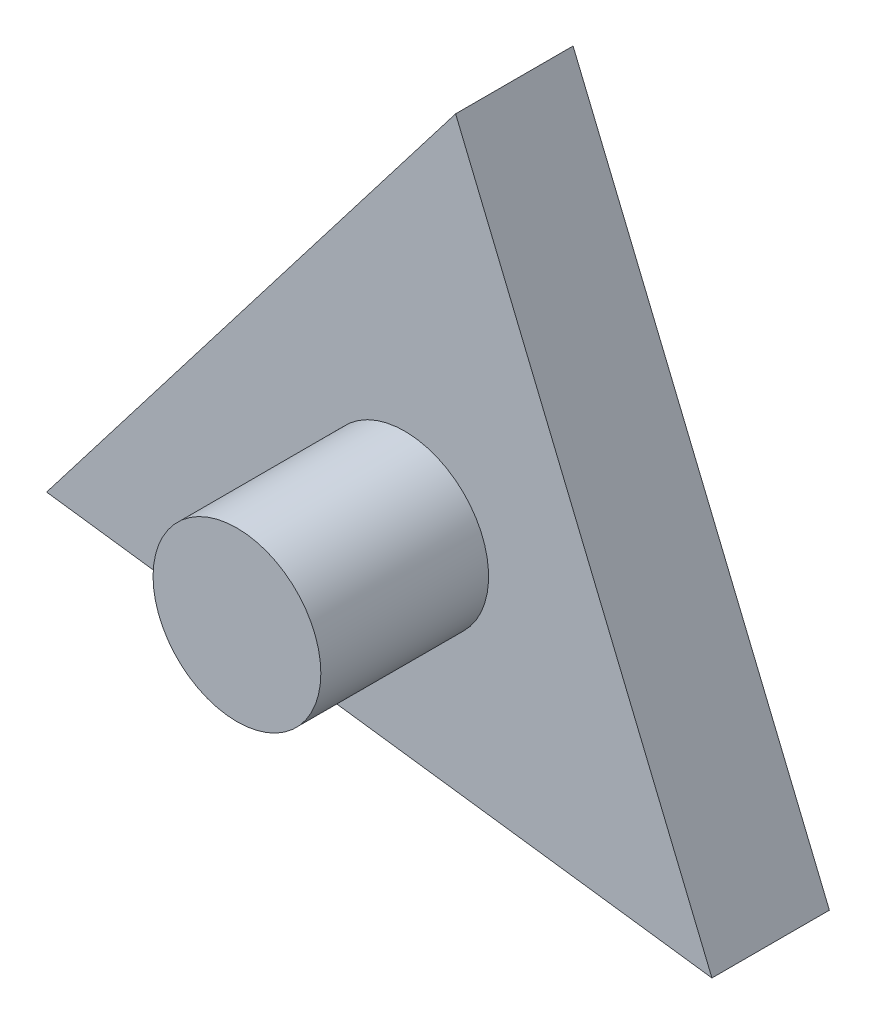
ISO-10303-21;
HEADER;
FILE_DESCRIPTION(('STEP AP214'),'2;1');
FILE_NAME('part.step','',(''),(''),'','','');
FILE_SCHEMA(('AUTOMOTIVE_DESIGN { 1 0 10303 214 1 1 1 1 }'));
ENDSEC;
DATA;
#1=APPLICATION_CONTEXT('core data for automotive mechanical design processes');
#2=APPLICATION_PROTOCOL_DEFINITION('international standard','automotive_design',2000,#1);
#3=PRODUCT_CONTEXT('',#1,'mechanical');
#4=PRODUCT('Part','Part','',(#3));
#5=PRODUCT_RELATED_PRODUCT_CATEGORY('part','',(#4));
#6=PRODUCT_DEFINITION_FORMATION('','',#4);
#7=PRODUCT_DEFINITION_CONTEXT('part definition',#1,'design');
#8=PRODUCT_DEFINITION('design','',#6,#7);
#9=PRODUCT_DEFINITION_SHAPE('','',#8);
#10=(LENGTH_UNIT() NAMED_UNIT(*) SI_UNIT(.MILLI.,.METRE.));
#11=(NAMED_UNIT(*) PLANE_ANGLE_UNIT() SI_UNIT($,.RADIAN.));
#12=(NAMED_UNIT(*) SI_UNIT($,.STERADIAN.) SOLID_ANGLE_UNIT());
#13=UNCERTAINTY_MEASURE_WITH_UNIT(LENGTH_MEASURE(1.E-05),#10,'distance_accuracy_value','');
#14=(GEOMETRIC_REPRESENTATION_CONTEXT(3) GLOBAL_UNCERTAINTY_ASSIGNED_CONTEXT((#13)) GLOBAL_UNIT_ASSIGNED_CONTEXT((#10,
#11,#12)) REPRESENTATION_CONTEXT('',''));
#15=CARTESIAN_POINT('',(0.,0.,0.));
#16=DIRECTION('',(0.,0.,1.));
#17=DIRECTION('',(1.,0.,0.));
#18=AXIS2_PLACEMENT_3D('',#15,#16,#17);
#19=CARTESIAN_POINT('',(18.309950916159,-14.0740552358296,7.));
#20=DIRECTION('',(0.131355005457612,0.991335393568307,0.));
#21=DIRECTION('',(-0.991335393568307,0.131355005457612,0.));
#22=AXIS2_PLACEMENT_3D('',#19,#20,#21);
#23=PLANE('',#22);
#24=DIRECTION('',(0.991335393568307,-0.131355005457612,0.));
#25=VECTOR('',#24,1.);
#26=CARTESIAN_POINT('',(18.309950916159,-14.0740552358296,0.));
#27=LINE('',#26,#25);
#28=CARTESIAN_POINT('',(-21.3434648265733,-8.81985501752508,0.));
#29=VERTEX_POINT('',#28);
#30=CARTESIAN_POINT('',(18.309950916159,-14.0740552358296,0.));
#31=VERTEX_POINT('',#30);
#32=EDGE_CURVE('E82',#29,#31,#27,.T.);
#33=ORIENTED_EDGE('',*,*,#32,.T.);
#34=DIRECTION('',(0.,0.,-1.));
#35=VECTOR('',#34,1.);
#36=CARTESIAN_POINT('',(18.309950916159,-14.0740552358296,7.));
#37=LINE('',#36,#35);
#38=CARTESIAN_POINT('',(18.309950916159,-14.0740552358296,7.));
#39=VERTEX_POINT('',#38);
#40=EDGE_CURVE('E41',#39,#31,#37,.T.);
#41=ORIENTED_EDGE('',*,*,#40,.F.);
#42=DIRECTION('',(0.991335393568307,-0.131355005457612,0.));
#43=VECTOR('',#42,1.);
#44=CARTESIAN_POINT('',(18.309950916159,-14.0740552358296,7.));
#45=LINE('',#44,#43);
#46=CARTESIAN_POINT('',(-21.3434648265733,-8.81985501752508,7.));
#47=VERTEX_POINT('',#46);
#48=EDGE_CURVE('E75',#47,#39,#45,.T.);
#49=ORIENTED_EDGE('',*,*,#48,.F.);
#50=DIRECTION('',(0.,0.,-1.));
#51=VECTOR('',#50,1.);
#52=CARTESIAN_POINT('',(-21.3434648265733,-8.81985501752508,7.));
#53=LINE('',#52,#51);
#54=EDGE_CURVE('E83',#47,#29,#53,.T.);
#55=ORIENTED_EDGE('',*,*,#54,.T.);
#56=EDGE_LOOP('',(#33,#41,#49,#55));
#57=FACE_BOUND('',#56,.T.);
#58=ADVANCED_FACE('F33',(#57),#23,.F.);
#59=CARTESIAN_POINT('',(3.03351391041432,22.8939102533546,7.));
#60=DIRECTION('',(-0.924199137229605,-0.381910925143618,0.));
#61=DIRECTION('',(0.381910925143618,-0.924199137229605,0.));
#62=AXIS2_PLACEMENT_3D('',#59,#60,#61);
#63=PLANE('',#62);
#64=DIRECTION('',(-0.381910925143618,0.924199137229605,0.));
#65=VECTOR('',#64,1.);
#66=CARTESIAN_POINT('',(3.03351391041432,22.8939102533546,0.));
#67=LINE('',#66,#65);
#68=CARTESIAN_POINT('',(3.03351391041432,22.8939102533546,0.));
#69=VERTEX_POINT('',#68);
#70=EDGE_CURVE('E62',#31,#69,#67,.T.);
#71=ORIENTED_EDGE('',*,*,#70,.T.);
#72=DIRECTION('',(0.,0.,-1.));
#73=VECTOR('',#72,1.);
#74=CARTESIAN_POINT('',(3.03351391041432,22.8939102533546,7.));
#75=LINE('',#74,#73);
#76=CARTESIAN_POINT('',(3.03351391041432,22.8939102533546,7.));
#77=VERTEX_POINT('',#76);
#78=EDGE_CURVE('E74',#77,#69,#75,.T.);
#79=ORIENTED_EDGE('',*,*,#78,.F.);
#80=DIRECTION('',(-0.381910925143618,0.924199137229605,0.));
#81=VECTOR('',#80,1.);
#82=CARTESIAN_POINT('',(3.03351391041432,22.8939102533546,7.));
#83=LINE('',#82,#81);
#84=EDGE_CURVE('E70',#39,#77,#83,.T.);
#85=ORIENTED_EDGE('',*,*,#84,.F.);
#86=ORIENTED_EDGE('',*,*,#40,.T.);
#87=EDGE_LOOP('',(#71,#79,#85,#86));
#88=FACE_BOUND('',#87,.T.);
#89=ADVANCED_FACE('F71',(#88),#63,.F.);
#90=CARTESIAN_POINT('',(-21.3434648265733,-8.81985501752508,7.));
#91=DIRECTION('',(0.792844131771992,-0.60942446842469,0.));
#92=DIRECTION('',(0.60942446842469,0.792844131771992,0.));
#93=AXIS2_PLACEMENT_3D('',#90,#91,#92);
#94=PLANE('',#93);
#95=DIRECTION('',(-0.60942446842469,-0.792844131771992,0.));
#96=VECTOR('',#95,1.);
#97=CARTESIAN_POINT('',(-21.3434648265733,-8.81985501752508,0.));
#98=LINE('',#97,#96);
#99=EDGE_CURVE('E67',#69,#29,#98,.T.);
#100=ORIENTED_EDGE('',*,*,#99,.T.);
#101=ORIENTED_EDGE('',*,*,#54,.F.);
#102=DIRECTION('',(-0.60942446842469,-0.792844131771992,0.));
#103=VECTOR('',#102,1.);
#104=CARTESIAN_POINT('',(-21.3434648265733,-8.81985501752508,7.));
#105=LINE('',#104,#103);
#106=EDGE_CURVE('E49',#77,#47,#105,.T.);
#107=ORIENTED_EDGE('',*,*,#106,.F.);
#108=ORIENTED_EDGE('',*,*,#78,.T.);
#109=EDGE_LOOP('',(#100,#101,#107,#108));
#110=FACE_BOUND('',#109,.T.);
#111=ADVANCED_FACE('F105',(#110),#94,.F.);
#112=CARTESIAN_POINT('',(0.,0.,7.));
#113=DIRECTION('',(0.,0.,-1.));
#114=DIRECTION('',(-1.,0.,0.));
#115=AXIS2_PLACEMENT_3D('',#112,#113,#114);
#116=PLANE('',#115);
#117=CARTESIAN_POINT('',(0.,0.,7.));
#118=DIRECTION('',(0.,0.,-1.));
#119=DIRECTION('',(-1.,0.,0.));
#120=AXIS2_PLACEMENT_3D('',#117,#118,#119);
#121=CIRCLE('',#120,5.);
#122=CARTESIAN_POINT('',(-5.,0.,7.));
#123=VERTEX_POINT('',#122);
#124=EDGE_CURVE('E11',#123,#123,#121,.F.);
#125=ORIENTED_EDGE('',*,*,#124,.F.);
#126=EDGE_LOOP('',(#125));
#127=FACE_BOUND('',#126,.T.);
#128=ORIENTED_EDGE('',*,*,#48,.T.);
#129=ORIENTED_EDGE('',*,*,#84,.T.);
#130=ORIENTED_EDGE('',*,*,#106,.T.);
#131=EDGE_LOOP('',(#128,#129,#130));
#132=FACE_BOUND('',#131,.T.);
#133=ADVANCED_FACE('F78',(#127,#132),#116,.F.);
#134=CARTESIAN_POINT('',(0.,0.,0.));
#135=DIRECTION('',(0.,0.,-1.));
#136=DIRECTION('',(-1.,0.,0.));
#137=AXIS2_PLACEMENT_3D('',#134,#135,#136);
#138=PLANE('',#137);
#139=ORIENTED_EDGE('',*,*,#32,.F.);
#140=ORIENTED_EDGE('',*,*,#99,.F.);
#141=ORIENTED_EDGE('',*,*,#70,.F.);
#142=EDGE_LOOP('',(#139,#140,#141));
#143=FACE_BOUND('',#142,.T.);
#144=ADVANCED_FACE('F100',(#143),#138,.T.);
#145=CARTESIAN_POINT('',(0.,0.,17.));
#146=DIRECTION('',(0.,0.,-1.));
#147=DIRECTION('',(-1.,0.,0.));
#148=AXIS2_PLACEMENT_3D('',#145,#146,#147);
#149=CYLINDRICAL_SURFACE('',#148,5.);
#150=CARTESIAN_POINT('',(0.,0.,17.));
#151=DIRECTION('',(0.,0.,1.));
#152=DIRECTION('',(1.,0.,0.));
#153=AXIS2_PLACEMENT_3D('',#150,#151,#152);
#154=CIRCLE('',#153,5.);
#155=CARTESIAN_POINT('',(5.,0.,17.));
#156=VERTEX_POINT('',#155);
#157=EDGE_CURVE('E90',#156,#156,#154,.T.);
#158=ORIENTED_EDGE('',*,*,#157,.F.);
#159=EDGE_LOOP('',(#158));
#160=FACE_BOUND('',#159,.T.);
#161=ORIENTED_EDGE('',*,*,#124,.T.);
#162=EDGE_LOOP('',(#161));
#163=FACE_BOUND('',#162,.T.);
#164=ADVANCED_FACE('F97',(#160,#163),#149,.T.);
#165=CARTESIAN_POINT('',(0.,0.,17.));
#166=DIRECTION('',(0.,0.,1.));
#167=DIRECTION('',(1.,0.,0.));
#168=AXIS2_PLACEMENT_3D('',#165,#166,#167);
#169=PLANE('',#168);
#170=ORIENTED_EDGE('',*,*,#157,.T.);
#171=EDGE_LOOP('',(#170));
#172=FACE_BOUND('',#171,.T.);
#173=ADVANCED_FACE('F95',(#172),#169,.T.);
#174=CLOSED_SHELL('',(#58,#89,#111,#133,#144,#164,#173));
#175=MANIFOLD_SOLID_BREP('B2',#174);
#176=ADVANCED_BREP_SHAPE_REPRESENTATION('',(#18,#175),#14);
#177=SHAPE_DEFINITION_REPRESENTATION(#9,#176);
ENDSEC;
END-ISO-10303-21;
